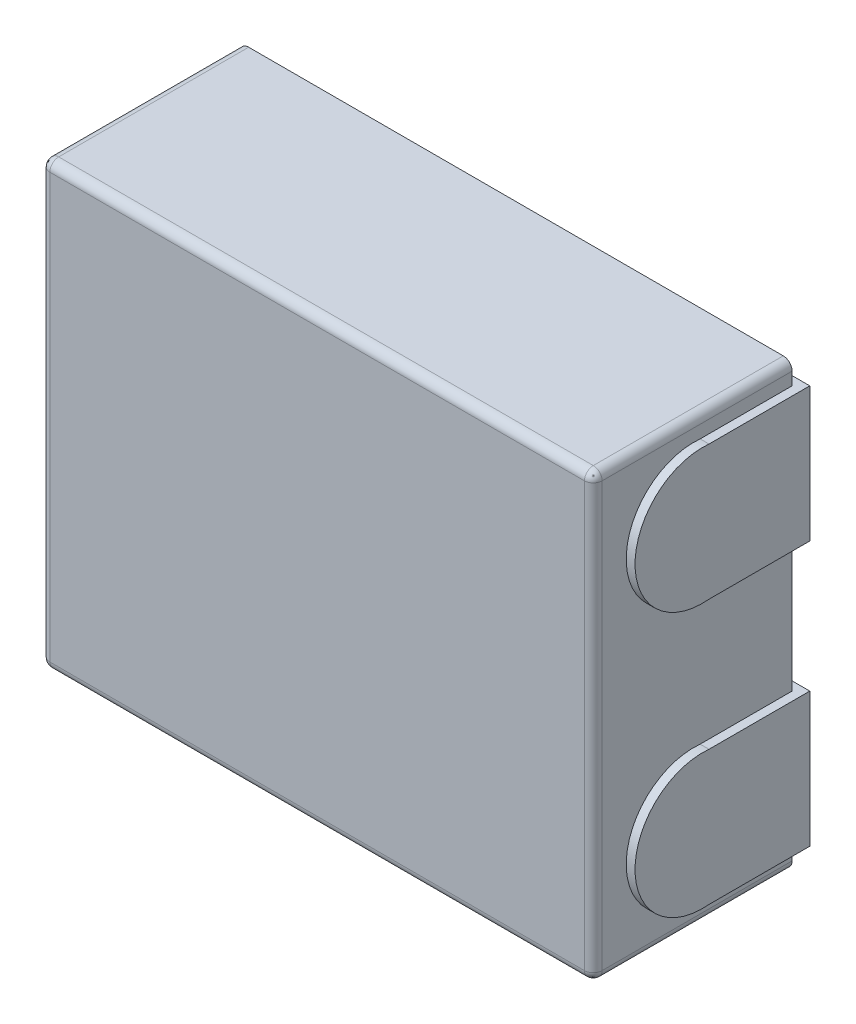
ISO-10303-21;
HEADER;
FILE_DESCRIPTION(('STEP AP214'),'2;1');
FILE_NAME('part.step','',(''),(''),'','','');
FILE_SCHEMA(('AUTOMOTIVE_DESIGN { 1 0 10303 214 1 1 1 1 }'));
ENDSEC;
DATA;
#1=APPLICATION_CONTEXT('core data for automotive mechanical design processes');
#2=APPLICATION_PROTOCOL_DEFINITION('international standard','automotive_design',2000,#1);
#3=PRODUCT_CONTEXT('',#1,'mechanical');
#4=PRODUCT('Part','Part','',(#3));
#5=PRODUCT_RELATED_PRODUCT_CATEGORY('part','',(#4));
#6=PRODUCT_DEFINITION_FORMATION('','',#4);
#7=PRODUCT_DEFINITION_CONTEXT('part definition',#1,'design');
#8=PRODUCT_DEFINITION('design','',#6,#7);
#9=PRODUCT_DEFINITION_SHAPE('','',#8);
#10=(LENGTH_UNIT() NAMED_UNIT(*) SI_UNIT(.MILLI.,.METRE.));
#11=(NAMED_UNIT(*) PLANE_ANGLE_UNIT() SI_UNIT($,.RADIAN.));
#12=(NAMED_UNIT(*) SI_UNIT($,.STERADIAN.) SOLID_ANGLE_UNIT());
#13=UNCERTAINTY_MEASURE_WITH_UNIT(LENGTH_MEASURE(1.E-05),#10,'distance_accuracy_value','');
#14=(GEOMETRIC_REPRESENTATION_CONTEXT(3) GLOBAL_UNCERTAINTY_ASSIGNED_CONTEXT((#13)) GLOBAL_UNIT_ASSIGNED_CONTEXT((#10,
#11,#12)) REPRESENTATION_CONTEXT('',''));
#15=CARTESIAN_POINT('',(0.,0.,0.));
#16=DIRECTION('',(0.,0.,1.));
#17=DIRECTION('',(1.,0.,0.));
#18=AXIS2_PLACEMENT_3D('',#15,#16,#17);
#19=CARTESIAN_POINT('',(-4.30252459766994,-0.304168853033011,-0.0199999999999997));
#20=DIRECTION('',(0.,0.,-1.));
#21=DIRECTION('',(-1.,0.,0.));
#22=AXIS2_PLACEMENT_3D('',#19,#20,#21);
#23=PLANE('',#22);
#24=DIRECTION('',(0.,-1.,0.));
#25=VECTOR('',#24,1.);
#26=CARTESIAN_POINT('',(-4.00252459766994,-0.152084426516506,-0.0199999999999998));
#27=LINE('',#26,#25);
#28=CARTESIAN_POINT('',(-4.00252459766994,0.,-0.0199999999999998));
#29=VERTEX_POINT('',#28);
#30=CARTESIAN_POINT('',(-4.00252459766994,-0.304168853033011,-0.0199999999999998));
#31=VERTEX_POINT('',#30);
#32=EDGE_CURVE('P0_E51',#29,#31,#27,.T.);
#33=ORIENTED_EDGE('',*,*,#32,.T.);
#34=DIRECTION('',(1.,0.,0.));
#35=VECTOR('',#34,1.);
#36=CARTESIAN_POINT('',(-4.30252459766994,-0.304168853033011,-0.0199999999999997));
#37=LINE('',#36,#35);
#38=CARTESIAN_POINT('',(-4.30252459766994,-0.304168853033011,-0.0199999999999997));
#39=VERTEX_POINT('',#38);
#40=EDGE_CURVE('P0_E70',#39,#31,#37,.T.);
#41=ORIENTED_EDGE('',*,*,#40,.F.);
#42=DIRECTION('',(0.,-1.,0.));
#43=VECTOR('',#42,1.);
#44=CARTESIAN_POINT('',(-4.30252459766994,-0.152084426516506,-0.0199999999999997));
#45=LINE('',#44,#43);
#46=CARTESIAN_POINT('',(-4.30252459766994,0.,-0.0199999999999998));
#47=VERTEX_POINT('',#46);
#48=EDGE_CURVE('P0_E60',#47,#39,#45,.T.);
#49=ORIENTED_EDGE('',*,*,#48,.F.);
#50=DIRECTION('',(1.,0.,0.));
#51=VECTOR('',#50,1.);
#52=CARTESIAN_POINT('',(-4.30252459766994,0.,-0.0199999999999998));
#53=LINE('',#52,#51);
#54=EDGE_CURVE('P0_E90',#29,#47,#53,.F.);
#55=ORIENTED_EDGE('',*,*,#54,.F.);
#56=EDGE_LOOP('',(#33,#41,#49,#55));
#57=FACE_BOUND('',#56,.T.);
#58=ADVANCED_FACE('P0_F16',(#57),#23,.T.);
#59=CARTESIAN_POINT('',(-4.30252459766994,-0.152084426516506,0.137210257429789));
#60=DIRECTION('',(-1.,0.,0.));
#61=DIRECTION('',(0.,-1.,0.));
#62=AXIS2_PLACEMENT_3D('',#59,#60,#61);
#63=PLANE('',#62);
#64=CARTESIAN_POINT('',(-4.30252459766994,-0.152084426516506,0.222703998621652));
#65=DIRECTION('',(1.,0.,0.));
#66=DIRECTION('',(0.,0.,-1.));
#67=AXIS2_PLACEMENT_3D('',#64,#65,#66);
#68=CIRCLE('',#67,0.152788159551015);
#69=CARTESIAN_POINT('',(-4.30252459766994,0.,0.208056510436575));
#70=VERTEX_POINT('',#69);
#71=CARTESIAN_POINT('',(-4.30252459766994,-0.304168853033011,0.208056510436569));
#72=VERTEX_POINT('',#71);
#73=EDGE_CURVE('P0_E19',#70,#72,#68,.T.);
#74=ORIENTED_EDGE('',*,*,#73,.F.);
#75=DIRECTION('',(0.,0.,1.));
#76=VECTOR('',#75,1.);
#77=CARTESIAN_POINT('',(-4.30252459766994,0.,-0.0199999999999997));
#78=LINE('',#77,#76);
#79=EDGE_CURVE('P0_E66',#47,#70,#78,.T.);
#80=ORIENTED_EDGE('',*,*,#79,.F.);
#81=ORIENTED_EDGE('',*,*,#48,.T.);
#82=DIRECTION('',(0.,0.,-1.));
#83=VECTOR('',#82,1.);
#84=CARTESIAN_POINT('',(-4.30252459766994,-0.304168853033011,0.208056510436572));
#85=LINE('',#84,#83);
#86=EDGE_CURVE('P0_E64',#72,#39,#85,.T.);
#87=ORIENTED_EDGE('',*,*,#86,.F.);
#88=EDGE_LOOP('',(#74,#80,#81,#87));
#89=FACE_BOUND('',#88,.T.);
#90=ADVANCED_FACE('P0_F62',(#89),#63,.T.);
#91=CARTESIAN_POINT('',(-4.30252459766994,-0.304168853033011,0.208056510436572));
#92=DIRECTION('',(0.,-1.,0.));
#93=DIRECTION('',(0.,0.,-1.));
#94=AXIS2_PLACEMENT_3D('',#91,#92,#93);
#95=PLANE('',#94);
#96=DIRECTION('',(0.,0.,1.));
#97=VECTOR('',#96,1.);
#98=CARTESIAN_POINT('',(-4.00252459766994,-0.304168853033011,0.137210257429789));
#99=LINE('',#98,#97);
#100=CARTESIAN_POINT('',(-4.00252459766994,-0.304168853033011,0.208056510436569));
#101=VERTEX_POINT('',#100);
#102=EDGE_CURVE('P0_E72',#31,#101,#99,.T.);
#103=ORIENTED_EDGE('',*,*,#102,.T.);
#104=DIRECTION('',(1.,0.,0.));
#105=VECTOR('',#104,1.);
#106=CARTESIAN_POINT('',(-4.30252459766994,-0.304168853033011,0.208056510436572));
#107=LINE('',#106,#105);
#108=EDGE_CURVE('P0_E76',#72,#101,#107,.T.);
#109=ORIENTED_EDGE('',*,*,#108,.F.);
#110=ORIENTED_EDGE('',*,*,#86,.T.);
#111=ORIENTED_EDGE('',*,*,#40,.T.);
#112=EDGE_LOOP('',(#103,#109,#110,#111));
#113=FACE_BOUND('',#112,.T.);
#114=ADVANCED_FACE('P0_F74',(#113),#95,.T.);
#115=CARTESIAN_POINT('',(-4.00252459766994,-0.152084426516506,0.137210257429789));
#116=DIRECTION('',(-1.,0.,0.));
#117=DIRECTION('',(0.,-1.,0.));
#118=AXIS2_PLACEMENT_3D('',#115,#116,#117);
#119=PLANE('',#118);
#120=DIRECTION('',(0.,0.,1.));
#121=VECTOR('',#120,1.);
#122=CARTESIAN_POINT('',(-4.00252459766994,0.,-0.0199999999999997));
#123=LINE('',#122,#121);
#124=CARTESIAN_POINT('',(-4.00252459766994,0.,0.208056510436575));
#125=VERTEX_POINT('',#124);
#126=EDGE_CURVE('P0_E34',#125,#29,#123,.F.);
#127=ORIENTED_EDGE('',*,*,#126,.F.);
#128=CARTESIAN_POINT('',(-4.00252459766994,-0.152084426516506,0.222703998621652));
#129=DIRECTION('',(1.,0.,0.));
#130=DIRECTION('',(0.,0.,-1.));
#131=AXIS2_PLACEMENT_3D('',#128,#129,#130);
#132=CIRCLE('',#131,0.152788159551015);
#133=EDGE_CURVE('P0_E25',#101,#125,#132,.F.);
#134=ORIENTED_EDGE('',*,*,#133,.F.);
#135=ORIENTED_EDGE('',*,*,#102,.F.);
#136=ORIENTED_EDGE('',*,*,#32,.F.);
#137=EDGE_LOOP('',(#127,#134,#135,#136));
#138=FACE_BOUND('',#137,.T.);
#139=ADVANCED_FACE('P0_F112',(#138),#119,.F.);
#140=CARTESIAN_POINT('',(-4.30252459766994,0.,-0.0199999999999997));
#141=DIRECTION('',(0.,1.,0.));
#142=DIRECTION('',(0.,0.,1.));
#143=AXIS2_PLACEMENT_3D('',#140,#141,#142);
#144=PLANE('',#143);
#145=ORIENTED_EDGE('',*,*,#126,.T.);
#146=ORIENTED_EDGE('',*,*,#54,.T.);
#147=ORIENTED_EDGE('',*,*,#79,.T.);
#148=DIRECTION('',(1.,0.,0.));
#149=VECTOR('',#148,1.);
#150=CARTESIAN_POINT('',(-4.30252459766994,0.,0.208056510436572));
#151=LINE('',#150,#149);
#152=EDGE_CURVE('P0_E11',#125,#70,#151,.F.);
#153=ORIENTED_EDGE('',*,*,#152,.F.);
#154=EDGE_LOOP('',(#145,#146,#147,#153));
#155=FACE_BOUND('',#154,.T.);
#156=ADVANCED_FACE('P0_F104',(#155),#144,.T.);
#157=CARTESIAN_POINT('',(-4.30252459766994,-0.152084426516506,0.222703998621652));
#158=DIRECTION('',(1.,0.,0.));
#159=DIRECTION('',(0.,0.,-1.));
#160=AXIS2_PLACEMENT_3D('',#157,#158,#159);
#161=CYLINDRICAL_SURFACE('',#160,0.152788159551015);
#162=ORIENTED_EDGE('',*,*,#133,.T.);
#163=ORIENTED_EDGE('',*,*,#152,.T.);
#164=ORIENTED_EDGE('',*,*,#73,.T.);
#165=ORIENTED_EDGE('',*,*,#108,.T.);
#166=EDGE_LOOP('',(#162,#163,#164,#165));
#167=FACE_BOUND('',#166,.T.);
#168=ADVANCED_FACE('P0_F105',(#167),#161,.T.);
#169=CLOSED_SHELL('',(#58,#90,#114,#139,#156,#168));
#170=MANIFOLD_SOLID_BREP('P0_B1',#169);
#171=CARTESIAN_POINT('',(-4.30252459766994,-0.902482697205198,-0.0199999999999997));
#172=DIRECTION('',(0.,0.,-1.));
#173=DIRECTION('',(-1.,0.,0.));
#174=AXIS2_PLACEMENT_3D('',#171,#172,#173);
#175=PLANE('',#174);
#176=DIRECTION('',(0.,1.,0.));
#177=VECTOR('',#176,1.);
#178=CARTESIAN_POINT('',(-4.00252459766994,-0.750398270688693,-0.0199999999999998));
#179=LINE('',#178,#177);
#180=CARTESIAN_POINT('',(-4.00252459766994,-0.902482697205198,-0.0199999999999998));
#181=VERTEX_POINT('',#180);
#182=CARTESIAN_POINT('',(-4.00252459766994,-0.598313844172187,-0.0199999999999998));
#183=VERTEX_POINT('',#182);
#184=EDGE_CURVE('P1_E51',#181,#183,#179,.T.);
#185=ORIENTED_EDGE('',*,*,#184,.F.);
#186=DIRECTION('',(1.,0.,0.));
#187=VECTOR('',#186,1.);
#188=CARTESIAN_POINT('',(-4.30252459766994,-0.902482697205198,-0.0199999999999997));
#189=LINE('',#188,#187);
#190=CARTESIAN_POINT('',(-4.30252459766994,-0.902482697205198,-0.0199999999999997));
#191=VERTEX_POINT('',#190);
#192=EDGE_CURVE('P1_E70',#191,#181,#189,.T.);
#193=ORIENTED_EDGE('',*,*,#192,.F.);
#194=DIRECTION('',(0.,1.,0.));
#195=VECTOR('',#194,1.);
#196=CARTESIAN_POINT('',(-4.30252459766994,-0.750398270688693,-0.0199999999999997));
#197=LINE('',#196,#195);
#198=CARTESIAN_POINT('',(-4.30252459766994,-0.598313844172187,-0.0199999999999998));
#199=VERTEX_POINT('',#198);
#200=EDGE_CURVE('P1_E60',#191,#199,#197,.T.);
#201=ORIENTED_EDGE('',*,*,#200,.T.);
#202=DIRECTION('',(1.,0.,0.));
#203=VECTOR('',#202,1.);
#204=CARTESIAN_POINT('',(-4.30252459766994,-0.598313844172187,-0.0199999999999998));
#205=LINE('',#204,#203);
#206=EDGE_CURVE('P1_E90',#183,#199,#205,.F.);
#207=ORIENTED_EDGE('',*,*,#206,.F.);
#208=EDGE_LOOP('',(#185,#193,#201,#207));
#209=FACE_BOUND('',#208,.T.);
#210=ADVANCED_FACE('P1_F16',(#209),#175,.T.);
#211=CARTESIAN_POINT('',(-4.30252459766994,-0.750398270688693,0.137210257429789));
#212=DIRECTION('',(1.,0.,0.));
#213=DIRECTION('',(0.,0.,-1.));
#214=AXIS2_PLACEMENT_3D('',#211,#212,#213);
#215=PLANE('',#214);
#216=ORIENTED_EDGE('',*,*,#200,.F.);
#217=DIRECTION('',(0.,0.,-1.));
#218=VECTOR('',#217,1.);
#219=CARTESIAN_POINT('',(-4.30252459766994,-0.902482697205198,0.208056510436572));
#220=LINE('',#219,#218);
#221=CARTESIAN_POINT('',(-4.30252459766994,-0.902482697205198,0.208056510436569));
#222=VERTEX_POINT('',#221);
#223=EDGE_CURVE('P1_E64',#222,#191,#220,.T.);
#224=ORIENTED_EDGE('',*,*,#223,.F.);
#225=CARTESIAN_POINT('',(-4.30252459766994,-0.750398270688693,0.222703998621652));
#226=DIRECTION('',(1.,0.,0.));
#227=DIRECTION('',(0.,0.,-1.));
#228=AXIS2_PLACEMENT_3D('',#225,#226,#227);
#229=CIRCLE('',#228,0.152788159551015);
#230=CARTESIAN_POINT('',(-4.30252459766994,-0.598313844172187,0.208056510436575));
#231=VERTEX_POINT('',#230);
#232=EDGE_CURVE('P1_E19',#231,#222,#229,.T.);
#233=ORIENTED_EDGE('',*,*,#232,.F.);
#234=DIRECTION('',(0.,0.,1.));
#235=VECTOR('',#234,1.);
#236=CARTESIAN_POINT('',(-4.30252459766994,-0.598313844172187,-0.0199999999999997));
#237=LINE('',#236,#235);
#238=EDGE_CURVE('P1_E66',#199,#231,#237,.T.);
#239=ORIENTED_EDGE('',*,*,#238,.F.);
#240=EDGE_LOOP('',(#216,#224,#233,#239));
#241=FACE_BOUND('',#240,.T.);
#242=ADVANCED_FACE('P1_F62',(#241),#215,.F.);
#243=CARTESIAN_POINT('',(-4.30252459766994,-0.902482697205198,0.208056510436572));
#244=DIRECTION('',(0.,-1.,0.));
#245=DIRECTION('',(0.,0.,-1.));
#246=AXIS2_PLACEMENT_3D('',#243,#244,#245);
#247=PLANE('',#246);
#248=DIRECTION('',(0.,0.,-1.));
#249=VECTOR('',#248,1.);
#250=CARTESIAN_POINT('',(-4.00252459766994,-0.902482697205198,0.137210257429789));
#251=LINE('',#250,#249);
#252=CARTESIAN_POINT('',(-4.00252459766994,-0.902482697205198,0.208056510436569));
#253=VERTEX_POINT('',#252);
#254=EDGE_CURVE('P1_E72',#253,#181,#251,.T.);
#255=ORIENTED_EDGE('',*,*,#254,.F.);
#256=DIRECTION('',(1.,0.,0.));
#257=VECTOR('',#256,1.);
#258=CARTESIAN_POINT('',(-4.30252459766994,-0.902482697205199,0.208056510436572));
#259=LINE('',#258,#257);
#260=EDGE_CURVE('P1_E76',#222,#253,#259,.T.);
#261=ORIENTED_EDGE('',*,*,#260,.F.);
#262=ORIENTED_EDGE('',*,*,#223,.T.);
#263=ORIENTED_EDGE('',*,*,#192,.T.);
#264=EDGE_LOOP('',(#255,#261,#262,#263));
#265=FACE_BOUND('',#264,.T.);
#266=ADVANCED_FACE('P1_F74',(#265),#247,.T.);
#267=CARTESIAN_POINT('',(-4.00252459766994,-0.750398270688693,0.137210257429789));
#268=DIRECTION('',(1.,0.,0.));
#269=DIRECTION('',(0.,0.,-1.));
#270=AXIS2_PLACEMENT_3D('',#267,#268,#269);
#271=PLANE('',#270);
#272=ORIENTED_EDGE('',*,*,#254,.T.);
#273=ORIENTED_EDGE('',*,*,#184,.T.);
#274=DIRECTION('',(0.,0.,1.));
#275=VECTOR('',#274,1.);
#276=CARTESIAN_POINT('',(-4.00252459766994,-0.598313844172187,-0.0199999999999997));
#277=LINE('',#276,#275);
#278=CARTESIAN_POINT('',(-4.00252459766994,-0.598313844172187,0.208056510436575));
#279=VERTEX_POINT('',#278);
#280=EDGE_CURVE('P1_E34',#279,#183,#277,.F.);
#281=ORIENTED_EDGE('',*,*,#280,.F.);
#282=CARTESIAN_POINT('',(-4.00252459766994,-0.750398270688693,0.222703998621652));
#283=DIRECTION('',(1.,0.,0.));
#284=DIRECTION('',(0.,0.,-1.));
#285=AXIS2_PLACEMENT_3D('',#282,#283,#284);
#286=CIRCLE('',#285,0.152788159551015);
#287=EDGE_CURVE('P1_E25',#253,#279,#286,.F.);
#288=ORIENTED_EDGE('',*,*,#287,.F.);
#289=EDGE_LOOP('',(#272,#273,#281,#288));
#290=FACE_BOUND('',#289,.T.);
#291=ADVANCED_FACE('P1_F112',(#290),#271,.T.);
#292=CARTESIAN_POINT('',(-4.30252459766994,-0.598313844172187,-0.0199999999999997));
#293=DIRECTION('',(0.,1.,0.));
#294=DIRECTION('',(0.,0.,1.));
#295=AXIS2_PLACEMENT_3D('',#292,#293,#294);
#296=PLANE('',#295);
#297=ORIENTED_EDGE('',*,*,#280,.T.);
#298=ORIENTED_EDGE('',*,*,#206,.T.);
#299=ORIENTED_EDGE('',*,*,#238,.T.);
#300=DIRECTION('',(1.,0.,0.));
#301=VECTOR('',#300,1.);
#302=CARTESIAN_POINT('',(-4.30252459766994,-0.598313844172187,0.208056510436572));
#303=LINE('',#302,#301);
#304=EDGE_CURVE('P1_E11',#279,#231,#303,.F.);
#305=ORIENTED_EDGE('',*,*,#304,.F.);
#306=EDGE_LOOP('',(#297,#298,#299,#305));
#307=FACE_BOUND('',#306,.T.);
#308=ADVANCED_FACE('P1_F104',(#307),#296,.T.);
#309=CARTESIAN_POINT('',(-4.30252459766994,-0.750398270688693,0.222703998621652));
#310=DIRECTION('',(1.,0.,0.));
#311=DIRECTION('',(0.,0.,-1.));
#312=AXIS2_PLACEMENT_3D('',#309,#310,#311);
#313=CYLINDRICAL_SURFACE('',#312,0.152788159551015);
#314=ORIENTED_EDGE('',*,*,#287,.T.);
#315=ORIENTED_EDGE('',*,*,#304,.T.);
#316=ORIENTED_EDGE('',*,*,#232,.T.);
#317=ORIENTED_EDGE('',*,*,#260,.T.);
#318=EDGE_LOOP('',(#314,#315,#316,#317));
#319=FACE_BOUND('',#318,.T.);
#320=ADVANCED_FACE('P1_F105',(#319),#313,.T.);
#321=CLOSED_SHELL('',(#210,#242,#266,#291,#308,#320));
#322=MANIFOLD_SOLID_BREP('P1_B1',#321);
#323=CARTESIAN_POINT('',(-3.65752459766994,-0.451241348602599,0.45));
#324=DIRECTION('',(0.,0.,1.));
#325=DIRECTION('',(1.,0.,0.));
#326=AXIS2_PLACEMENT_3D('',#323,#324,#325);
#327=PLANE('',#326);
#328=DIRECTION('',(-1.,0.,0.));
#329=VECTOR('',#328,1.);
#330=CARTESIAN_POINT('',(-3.34502459766994,0.0287586513974009,0.45));
#331=LINE('',#330,#329);
#332=CARTESIAN_POINT('',(-4.26252459766994,0.0287586513974009,0.45));
#333=VERTEX_POINT('',#332);
#334=CARTESIAN_POINT('',(-3.05252459766994,0.0287586513974009,0.45));
#335=VERTEX_POINT('',#334);
#336=EDGE_CURVE('P2_E260',#333,#335,#331,.F.);
#337=ORIENTED_EDGE('',*,*,#336,.F.);
#338=DIRECTION('',(0.,-1.,0.));
#339=VECTOR('',#338,1.);
#340=CARTESIAN_POINT('',(-4.26252459766994,-0.201241348602599,0.45));
#341=LINE('',#340,#339);
#342=CARTESIAN_POINT('',(-4.26252459766994,-0.931241348602599,0.45));
#343=VERTEX_POINT('',#342);
#344=EDGE_CURVE('P2_E258',#343,#333,#341,.F.);
#345=ORIENTED_EDGE('',*,*,#344,.F.);
#346=DIRECTION('',(1.,0.,0.));
#347=VECTOR('',#346,1.);
#348=CARTESIAN_POINT('',(-3.97002459766994,-0.931241348602599,0.45));
#349=LINE('',#348,#347);
#350=CARTESIAN_POINT('',(-3.05252459766994,-0.931241348602599,0.45));
#351=VERTEX_POINT('',#350);
#352=EDGE_CURVE('P2_E253',#351,#343,#349,.F.);
#353=ORIENTED_EDGE('',*,*,#352,.F.);
#354=DIRECTION('',(0.,1.,0.));
#355=VECTOR('',#354,1.);
#356=CARTESIAN_POINT('',(-3.05252459766994,-0.701241348602599,0.45));
#357=LINE('',#356,#355);
#358=EDGE_CURVE('P2_E95',#335,#351,#357,.F.);
#359=ORIENTED_EDGE('',*,*,#358,.F.);
#360=EDGE_LOOP('',(#337,#345,#353,#359));
#361=FACE_BOUND('',#360,.T.);
#362=ADVANCED_FACE('P2_F16',(#361),#327,.T.);
#363=CARTESIAN_POINT('',(-3.05252459766994,-0.701241348602599,0.43));
#364=DIRECTION('',(0.,1.,0.));
#365=DIRECTION('',(0.,0.,1.));
#366=AXIS2_PLACEMENT_3D('',#363,#364,#365);
#367=CYLINDRICAL_SURFACE('',#366,0.02);
#368=CARTESIAN_POINT('',(-3.05252459766994,-0.931241348602599,0.43));
#369=DIRECTION('',(0.,1.,0.));
#370=DIRECTION('',(0.,0.,1.));
#371=AXIS2_PLACEMENT_3D('',#368,#369,#370);
#372=CIRCLE('',#371,0.02);
#373=CARTESIAN_POINT('',(-3.03252459766994,-0.931241348602599,0.43));
#374=VERTEX_POINT('',#373);
#375=EDGE_CURVE('P2_E246',#374,#351,#372,.F.);
#376=ORIENTED_EDGE('',*,*,#375,.F.);
#377=DIRECTION('',(0.,1.,0.));
#378=VECTOR('',#377,1.);
#379=CARTESIAN_POINT('',(-3.03252459766994,-0.951241348602599,0.43));
#380=LINE('',#379,#378);
#381=CARTESIAN_POINT('',(-3.03252459766994,0.0287586513974009,0.43));
#382=VERTEX_POINT('',#381);
#383=EDGE_CURVE('P2_E118',#382,#374,#380,.F.);
#384=ORIENTED_EDGE('',*,*,#383,.F.);
#385=CARTESIAN_POINT('',(-3.05252459766994,0.0287586513974009,0.43));
#386=DIRECTION('',(0.,1.,0.));
#387=DIRECTION('',(0.,0.,1.));
#388=AXIS2_PLACEMENT_3D('',#385,#386,#387);
#389=CIRCLE('',#388,0.02);
#390=EDGE_CURVE('P2_E19',#335,#382,#389,.T.);
#391=ORIENTED_EDGE('',*,*,#390,.F.);
#392=ORIENTED_EDGE('',*,*,#358,.T.);
#393=EDGE_LOOP('',(#376,#384,#391,#392));
#394=FACE_BOUND('',#393,.T.);
#395=ADVANCED_FACE('P2_F104',(#394),#367,.T.);
#396=CARTESIAN_POINT('',(-3.05252459766994,0.0287586513974009,0.43));
#397=DIRECTION('',(0.577350269189631,0.577350269189627,0.57735026918962));
#398=DIRECTION('',(-0.707106781186543,0.,0.707106781186552));
#399=AXIS2_PLACEMENT_3D('',#396,#397,#398);
#400=SPHERICAL_SURFACE('',#399,0.02);
#401=CARTESIAN_POINT('',(-3.04097759228615,0.0403056567811935,0.441547005383792));
#402=VERTEX_POINT('',#401);
#403=VERTEX_LOOP('',#402);
#404=FACE_BOUND('',#403,.T.);
#405=CARTESIAN_POINT('',(-3.05252459766994,0.0287586513974009,0.43));
#406=DIRECTION('',(0.,0.,1.));
#407=DIRECTION('',(1.,0.,0.));
#408=AXIS2_PLACEMENT_3D('',#405,#406,#407);
#409=CIRCLE('',#408,0.02);
#410=CARTESIAN_POINT('',(-3.05252459766994,0.0487586513974009,0.43));
#411=VERTEX_POINT('',#410);
#412=EDGE_CURVE('P2_E110',#411,#382,#409,.F.);
#413=ORIENTED_EDGE('',*,*,#412,.F.);
#414=CARTESIAN_POINT('',(-3.05252459766994,0.0287586513974009,0.43));
#415=DIRECTION('',(-1.,0.,0.));
#416=DIRECTION('',(0.,0.,1.));
#417=AXIS2_PLACEMENT_3D('',#414,#415,#416);
#418=CIRCLE('',#417,0.02);
#419=EDGE_CURVE('P2_E112',#335,#411,#418,.T.);
#420=ORIENTED_EDGE('',*,*,#419,.F.);
#421=ORIENTED_EDGE('',*,*,#390,.T.);
#422=EDGE_LOOP('',(#413,#420,#421));
#423=FACE_BOUND('',#422,.T.);
#424=ADVANCED_FACE('P2_F100',(#404,#423),#400,.T.);
#425=CARTESIAN_POINT('',(-3.34502459766994,0.0287586513974009,0.43));
#426=DIRECTION('',(-1.,0.,0.));
#427=DIRECTION('',(0.,0.,1.));
#428=AXIS2_PLACEMENT_3D('',#425,#426,#427);
#429=CYLINDRICAL_SURFACE('',#428,0.02);
#430=ORIENTED_EDGE('',*,*,#419,.T.);
#431=DIRECTION('',(1.,0.,0.));
#432=VECTOR('',#431,1.);
#433=CARTESIAN_POINT('',(-3.03252459766994,0.0487586513974009,0.43));
#434=LINE('',#433,#432);
#435=CARTESIAN_POINT('',(-4.26252459766994,0.0487586513974009,0.43));
#436=VERTEX_POINT('',#435);
#437=EDGE_CURVE('P2_E123',#436,#411,#434,.T.);
#438=ORIENTED_EDGE('',*,*,#437,.F.);
#439=CARTESIAN_POINT('',(-4.26252459766994,0.0287586513974009,0.43));
#440=DIRECTION('',(-1.,0.,0.));
#441=DIRECTION('',(0.,0.,1.));
#442=AXIS2_PLACEMENT_3D('',#439,#440,#441);
#443=CIRCLE('',#442,0.02);
#444=EDGE_CURVE('P2_E259',#333,#436,#443,.T.);
#445=ORIENTED_EDGE('',*,*,#444,.F.);
#446=ORIENTED_EDGE('',*,*,#336,.T.);
#447=EDGE_LOOP('',(#430,#438,#445,#446));
#448=FACE_BOUND('',#447,.T.);
#449=ADVANCED_FACE('P2_F103',(#448),#429,.T.);
#450=CARTESIAN_POINT('',(-4.26252459766994,0.0287586513974009,0.43));
#451=DIRECTION('',(-0.577350269189624,0.577350269189616,0.577350269189638));
#452=DIRECTION('',(-0.70710678118656,0.,-0.707106781186535));
#453=AXIS2_PLACEMENT_3D('',#450,#451,#452);
#454=SPHERICAL_SURFACE('',#453,0.02);
#455=CARTESIAN_POINT('',(-4.27407160305373,0.0403056567811933,0.441547005383793));
#456=VERTEX_POINT('',#455);
#457=VERTEX_LOOP('',#456);
#458=FACE_BOUND('',#457,.T.);
#459=CARTESIAN_POINT('',(-4.26252459766994,0.0287586513974009,0.43));
#460=DIRECTION('',(0.,0.,1.));
#461=DIRECTION('',(1.,0.,0.));
#462=AXIS2_PLACEMENT_3D('',#459,#460,#461);
#463=CIRCLE('',#462,0.02);
#464=CARTESIAN_POINT('',(-4.28252459766994,0.0287586513974009,0.43));
#465=VERTEX_POINT('',#464);
#466=EDGE_CURVE('P2_E131',#465,#436,#463,.F.);
#467=ORIENTED_EDGE('',*,*,#466,.F.);
#468=CARTESIAN_POINT('',(-4.26252459766994,0.0287586513974009,0.43));
#469=DIRECTION('',(0.,-1.,0.));
#470=DIRECTION('',(0.,0.,-1.));
#471=AXIS2_PLACEMENT_3D('',#468,#469,#470);
#472=CIRCLE('',#471,0.02);
#473=EDGE_CURVE('P2_E256',#333,#465,#472,.T.);
#474=ORIENTED_EDGE('',*,*,#473,.F.);
#475=ORIENTED_EDGE('',*,*,#444,.T.);
#476=EDGE_LOOP('',(#467,#474,#475));
#477=FACE_BOUND('',#476,.T.);
#478=ADVANCED_FACE('P2_F176',(#458,#477),#454,.T.);
#479=CARTESIAN_POINT('',(-4.26252459766994,-0.201241348602599,0.43));
#480=DIRECTION('',(0.,-1.,0.));
#481=DIRECTION('',(0.,0.,-1.));
#482=AXIS2_PLACEMENT_3D('',#479,#480,#481);
#483=CYLINDRICAL_SURFACE('',#482,0.02);
#484=ORIENTED_EDGE('',*,*,#473,.T.);
#485=DIRECTION('',(0.,1.,0.));
#486=VECTOR('',#485,1.);
#487=CARTESIAN_POINT('',(-4.28252459766994,0.0487586513974009,0.43));
#488=LINE('',#487,#486);
#489=CARTESIAN_POINT('',(-4.28252459766994,-0.931241348602599,0.43));
#490=VERTEX_POINT('',#489);
#491=EDGE_CURVE('P2_E170',#490,#465,#488,.T.);
#492=ORIENTED_EDGE('',*,*,#491,.F.);
#493=CARTESIAN_POINT('',(-4.26252459766994,-0.931241348602599,0.43));
#494=DIRECTION('',(0.,-1.,0.));
#495=DIRECTION('',(0.,0.,-1.));
#496=AXIS2_PLACEMENT_3D('',#493,#494,#495);
#497=CIRCLE('',#496,0.02);
#498=EDGE_CURVE('P2_E254',#343,#490,#497,.T.);
#499=ORIENTED_EDGE('',*,*,#498,.F.);
#500=ORIENTED_EDGE('',*,*,#344,.T.);
#501=EDGE_LOOP('',(#484,#492,#499,#500));
#502=FACE_BOUND('',#501,.T.);
#503=ADVANCED_FACE('P2_F166',(#502),#483,.T.);
#504=CARTESIAN_POINT('',(-4.26252459766994,-0.931241348602599,0.43));
#505=DIRECTION('',(-0.577350269189625,-0.577350269189616,0.577350269189637));
#506=DIRECTION('',(-0.707106781186559,0.,-0.707106781186536));
#507=AXIS2_PLACEMENT_3D('',#504,#505,#506);
#508=SPHERICAL_SURFACE('',#507,0.02);
#509=CARTESIAN_POINT('',(-4.27407160305373,-0.942788353986391,0.441547005383793));
#510=VERTEX_POINT('',#509);
#511=VERTEX_LOOP('',#510);
#512=FACE_BOUND('',#511,.T.);
#513=CARTESIAN_POINT('',(-4.26252459766994,-0.931241348602599,0.43));
#514=DIRECTION('',(0.,0.,1.));
#515=DIRECTION('',(1.,0.,0.));
#516=AXIS2_PLACEMENT_3D('',#513,#514,#515);
#517=CIRCLE('',#516,0.02);
#518=CARTESIAN_POINT('',(-4.26252459766994,-0.951241348602599,0.43));
#519=VERTEX_POINT('',#518);
#520=EDGE_CURVE('P2_E240',#519,#490,#517,.F.);
#521=ORIENTED_EDGE('',*,*,#520,.F.);
#522=CARTESIAN_POINT('',(-4.26252459766994,-0.931241348602599,0.43));
#523=DIRECTION('',(1.,0.,0.));
#524=DIRECTION('',(0.,0.,-1.));
#525=AXIS2_PLACEMENT_3D('',#522,#523,#524);
#526=CIRCLE('',#525,0.02);
#527=EDGE_CURVE('P2_E251',#343,#519,#526,.T.);
#528=ORIENTED_EDGE('',*,*,#527,.F.);
#529=ORIENTED_EDGE('',*,*,#498,.T.);
#530=EDGE_LOOP('',(#521,#528,#529));
#531=FACE_BOUND('',#530,.T.);
#532=ADVANCED_FACE('P2_F161',(#512,#531),#508,.T.);
#533=CARTESIAN_POINT('',(-3.97002459766994,-0.931241348602599,0.43));
#534=DIRECTION('',(1.,0.,0.));
#535=DIRECTION('',(0.,0.,-1.));
#536=AXIS2_PLACEMENT_3D('',#533,#534,#535);
#537=CYLINDRICAL_SURFACE('',#536,0.02);
#538=ORIENTED_EDGE('',*,*,#527,.T.);
#539=DIRECTION('',(1.,0.,0.));
#540=VECTOR('',#539,1.);
#541=CARTESIAN_POINT('',(-4.28252459766994,-0.951241348602599,0.43));
#542=LINE('',#541,#540);
#543=CARTESIAN_POINT('',(-3.05252459766994,-0.951241348602599,0.43));
#544=VERTEX_POINT('',#543);
#545=EDGE_CURVE('P2_E142',#544,#519,#542,.F.);
#546=ORIENTED_EDGE('',*,*,#545,.F.);
#547=CARTESIAN_POINT('',(-3.05252459766994,-0.931241348602599,0.43));
#548=DIRECTION('',(1.,0.,0.));
#549=DIRECTION('',(0.,0.,-1.));
#550=AXIS2_PLACEMENT_3D('',#547,#548,#549);
#551=CIRCLE('',#550,0.02);
#552=EDGE_CURVE('P2_E249',#351,#544,#551,.T.);
#553=ORIENTED_EDGE('',*,*,#552,.F.);
#554=ORIENTED_EDGE('',*,*,#352,.T.);
#555=EDGE_LOOP('',(#538,#546,#553,#554));
#556=FACE_BOUND('',#555,.T.);
#557=ADVANCED_FACE('P2_F156',(#556),#537,.T.);
#558=CARTESIAN_POINT('',(-3.05252459766994,-0.931241348602599,0.43));
#559=DIRECTION('',(0.577350269189631,-0.577350269189626,0.57735026918962));
#560=DIRECTION('',(-0.707106781186543,0.,0.707106781186552));
#561=AXIS2_PLACEMENT_3D('',#558,#559,#560);
#562=SPHERICAL_SURFACE('',#561,0.02);
#563=CARTESIAN_POINT('',(-3.04097759228615,-0.942788353986391,0.441547005383792));
#564=VERTEX_POINT('',#563);
#565=VERTEX_LOOP('',#564);
#566=FACE_BOUND('',#565,.T.);
#567=CARTESIAN_POINT('',(-3.05252459766994,-0.931241348602599,0.43));
#568=DIRECTION('',(0.,0.,1.));
#569=DIRECTION('',(1.,0.,0.));
#570=AXIS2_PLACEMENT_3D('',#567,#568,#569);
#571=CIRCLE('',#570,0.02);
#572=EDGE_CURVE('P2_E237',#374,#544,#571,.F.);
#573=ORIENTED_EDGE('',*,*,#572,.F.);
#574=ORIENTED_EDGE('',*,*,#375,.T.);
#575=ORIENTED_EDGE('',*,*,#552,.T.);
#576=EDGE_LOOP('',(#573,#574,#575));
#577=FACE_BOUND('',#576,.T.);
#578=ADVANCED_FACE('P2_F151',(#566,#577),#562,.T.);
#579=CARTESIAN_POINT('',(-3.03252459766994,-0.951241348602599,0.));
#580=DIRECTION('',(1.,0.,0.));
#581=DIRECTION('',(0.,0.,-1.));
#582=AXIS2_PLACEMENT_3D('',#579,#580,#581);
#583=PLANE('',#582);
#584=DIRECTION('',(0.,0.,1.));
#585=VECTOR('',#584,1.);
#586=CARTESIAN_POINT('',(-3.03252459766994,0.0287586513974009,0.));
#587=LINE('',#586,#585);
#588=CARTESIAN_POINT('',(-3.03252459766994,0.0287586513974009,0.));
#589=VERTEX_POINT('',#588);
#590=EDGE_CURVE('P2_E117',#382,#589,#587,.F.);
#591=ORIENTED_EDGE('',*,*,#590,.F.);
#592=ORIENTED_EDGE('',*,*,#383,.T.);
#593=DIRECTION('',(0.,0.,1.));
#594=VECTOR('',#593,1.);
#595=CARTESIAN_POINT('',(-3.03252459766994,-0.931241348602599,0.));
#596=LINE('',#595,#594);
#597=CARTESIAN_POINT('',(-3.03252459766994,-0.931241348602599,0.));
#598=VERTEX_POINT('',#597);
#599=EDGE_CURVE('P2_E239',#598,#374,#596,.T.);
#600=ORIENTED_EDGE('',*,*,#599,.F.);
#601=DIRECTION('',(0.,1.,0.));
#602=VECTOR('',#601,1.);
#603=CARTESIAN_POINT('',(-3.03252459766994,-0.451241348602599,0.));
#604=LINE('',#603,#602);
#605=EDGE_CURVE('P2_E227',#598,#589,#604,.T.);
#606=ORIENTED_EDGE('',*,*,#605,.T.);
#607=EDGE_LOOP('',(#591,#592,#600,#606));
#608=FACE_BOUND('',#607,.T.);
#609=ADVANCED_FACE('P2_F155',(#608),#583,.T.);
#610=CARTESIAN_POINT('',(-3.05252459766994,0.0287586513974009,0.));
#611=DIRECTION('',(0.,0.,1.));
#612=DIRECTION('',(1.,0.,0.));
#613=AXIS2_PLACEMENT_3D('',#610,#611,#612);
#614=CYLINDRICAL_SURFACE('',#613,0.02);
#615=ORIENTED_EDGE('',*,*,#412,.T.);
#616=ORIENTED_EDGE('',*,*,#590,.T.);
#617=CARTESIAN_POINT('',(-3.05252459766994,0.0287586513974009,0.));
#618=DIRECTION('',(0.,0.,1.));
#619=DIRECTION('',(1.,0.,0.));
#620=AXIS2_PLACEMENT_3D('',#617,#618,#619);
#621=CIRCLE('',#620,0.02);
#622=CARTESIAN_POINT('',(-3.05252459766994,0.0487586513974009,0.));
#623=VERTEX_POINT('',#622);
#624=EDGE_CURVE('P2_E136',#589,#623,#621,.T.);
#625=ORIENTED_EDGE('',*,*,#624,.T.);
#626=DIRECTION('',(0.,0.,1.));
#627=VECTOR('',#626,1.);
#628=CARTESIAN_POINT('',(-3.05252459766994,0.0487586513974009,0.));
#629=LINE('',#628,#627);
#630=EDGE_CURVE('P2_E126',#411,#623,#629,.F.);
#631=ORIENTED_EDGE('',*,*,#630,.F.);
#632=EDGE_LOOP('',(#615,#616,#625,#631));
#633=FACE_BOUND('',#632,.T.);
#634=ADVANCED_FACE('P2_F134',(#633),#614,.T.);
#635=CARTESIAN_POINT('',(-3.03252459766994,0.0487586513974009,0.));
#636=DIRECTION('',(0.,1.,0.));
#637=DIRECTION('',(0.,0.,1.));
#638=AXIS2_PLACEMENT_3D('',#635,#636,#637);
#639=PLANE('',#638);
#640=DIRECTION('',(0.,0.,1.));
#641=VECTOR('',#640,1.);
#642=CARTESIAN_POINT('',(-4.26252459766994,0.0487586513974009,0.));
#643=LINE('',#642,#641);
#644=CARTESIAN_POINT('',(-4.26252459766994,0.0487586513974009,0.));
#645=VERTEX_POINT('',#644);
#646=EDGE_CURVE('P2_E128',#436,#645,#643,.F.);
#647=ORIENTED_EDGE('',*,*,#646,.F.);
#648=ORIENTED_EDGE('',*,*,#437,.T.);
#649=ORIENTED_EDGE('',*,*,#630,.T.);
#650=DIRECTION('',(1.,0.,0.));
#651=VECTOR('',#650,1.);
#652=CARTESIAN_POINT('',(-3.65752459766994,0.0487586513974009,0.));
#653=LINE('',#652,#651);
#654=EDGE_CURVE('P2_E229',#623,#645,#653,.F.);
#655=ORIENTED_EDGE('',*,*,#654,.T.);
#656=EDGE_LOOP('',(#647,#648,#649,#655));
#657=FACE_BOUND('',#656,.T.);
#658=ADVANCED_FACE('P2_F124',(#657),#639,.T.);
#659=CARTESIAN_POINT('',(-4.26252459766994,0.0287586513974009,0.));
#660=DIRECTION('',(0.,0.,1.));
#661=DIRECTION('',(1.,0.,0.));
#662=AXIS2_PLACEMENT_3D('',#659,#660,#661);
#663=CYLINDRICAL_SURFACE('',#662,0.02);
#664=ORIENTED_EDGE('',*,*,#466,.T.);
#665=ORIENTED_EDGE('',*,*,#646,.T.);
#666=CARTESIAN_POINT('',(-4.26252459766994,0.0287586513974009,0.));
#667=DIRECTION('',(0.,0.,1.));
#668=DIRECTION('',(1.,0.,0.));
#669=AXIS2_PLACEMENT_3D('',#666,#667,#668);
#670=CIRCLE('',#669,0.02);
#671=CARTESIAN_POINT('',(-4.28252459766994,0.0287586513974009,0.));
#672=VERTEX_POINT('',#671);
#673=EDGE_CURVE('P2_E231',#645,#672,#670,.T.);
#674=ORIENTED_EDGE('',*,*,#673,.T.);
#675=DIRECTION('',(0.,0.,1.));
#676=VECTOR('',#675,1.);
#677=CARTESIAN_POINT('',(-4.28252459766994,0.0287586513974009,0.));
#678=LINE('',#677,#676);
#679=EDGE_CURVE('P2_E243',#465,#672,#678,.F.);
#680=ORIENTED_EDGE('',*,*,#679,.F.);
#681=EDGE_LOOP('',(#664,#665,#674,#680));
#682=FACE_BOUND('',#681,.T.);
#683=ADVANCED_FACE('P2_F210',(#682),#663,.T.);
#684=CARTESIAN_POINT('',(-4.28252459766994,0.0487586513974009,0.));
#685=DIRECTION('',(-1.,0.,0.));
#686=DIRECTION('',(0.,0.,1.));
#687=AXIS2_PLACEMENT_3D('',#684,#685,#686);
#688=PLANE('',#687);
#689=ORIENTED_EDGE('',*,*,#679,.T.);
#690=DIRECTION('',(0.,1.,0.));
#691=VECTOR('',#690,1.);
#692=CARTESIAN_POINT('',(-4.28252459766994,-0.451241348602599,0.));
#693=LINE('',#692,#691);
#694=CARTESIAN_POINT('',(-4.28252459766994,-0.931241348602599,0.));
#695=VERTEX_POINT('',#694);
#696=EDGE_CURVE('P2_E266',#672,#695,#693,.F.);
#697=ORIENTED_EDGE('',*,*,#696,.T.);
#698=DIRECTION('',(0.,0.,1.));
#699=VECTOR('',#698,1.);
#700=CARTESIAN_POINT('',(-4.28252459766994,-0.931241348602599,0.));
#701=LINE('',#700,#699);
#702=EDGE_CURVE('P2_E146',#490,#695,#701,.F.);
#703=ORIENTED_EDGE('',*,*,#702,.F.);
#704=ORIENTED_EDGE('',*,*,#491,.T.);
#705=EDGE_LOOP('',(#689,#697,#703,#704));
#706=FACE_BOUND('',#705,.T.);
#707=ADVANCED_FACE('P2_F206',(#706),#688,.T.);
#708=CARTESIAN_POINT('',(-4.26252459766994,-0.931241348602599,0.));
#709=DIRECTION('',(0.,0.,1.));
#710=DIRECTION('',(1.,0.,0.));
#711=AXIS2_PLACEMENT_3D('',#708,#709,#710);
#712=CYLINDRICAL_SURFACE('',#711,0.02);
#713=ORIENTED_EDGE('',*,*,#520,.T.);
#714=ORIENTED_EDGE('',*,*,#702,.T.);
#715=CARTESIAN_POINT('',(-4.26252459766994,-0.931241348602599,0.));
#716=DIRECTION('',(0.,0.,1.));
#717=DIRECTION('',(1.,0.,0.));
#718=AXIS2_PLACEMENT_3D('',#715,#716,#717);
#719=CIRCLE('',#718,0.02);
#720=CARTESIAN_POINT('',(-4.26252459766994,-0.951241348602599,0.));
#721=VERTEX_POINT('',#720);
#722=EDGE_CURVE('P2_E264',#695,#721,#719,.T.);
#723=ORIENTED_EDGE('',*,*,#722,.T.);
#724=DIRECTION('',(0.,0.,-1.));
#725=VECTOR('',#724,1.);
#726=CARTESIAN_POINT('',(-4.26252459766994,-0.951241348602599,0.));
#727=LINE('',#726,#725);
#728=EDGE_CURVE('P2_E145',#519,#721,#727,.T.);
#729=ORIENTED_EDGE('',*,*,#728,.F.);
#730=EDGE_LOOP('',(#713,#714,#723,#729));
#731=FACE_BOUND('',#730,.T.);
#732=ADVANCED_FACE('P2_F202',(#731),#712,.T.);
#733=CARTESIAN_POINT('',(-4.28252459766994,-0.951241348602599,0.));
#734=DIRECTION('',(0.,-1.,0.));
#735=DIRECTION('',(0.,0.,-1.));
#736=AXIS2_PLACEMENT_3D('',#733,#734,#735);
#737=PLANE('',#736);
#738=ORIENTED_EDGE('',*,*,#728,.T.);
#739=DIRECTION('',(1.,0.,0.));
#740=VECTOR('',#739,1.);
#741=CARTESIAN_POINT('',(-3.65752459766994,-0.951241348602599,0.));
#742=LINE('',#741,#740);
#743=CARTESIAN_POINT('',(-3.05252459766994,-0.951241348602599,0.));
#744=VERTEX_POINT('',#743);
#745=EDGE_CURVE('P2_E25',#721,#744,#742,.T.);
#746=ORIENTED_EDGE('',*,*,#745,.T.);
#747=DIRECTION('',(0.,0.,1.));
#748=VECTOR('',#747,1.);
#749=CARTESIAN_POINT('',(-3.05252459766994,-0.951241348602599,0.));
#750=LINE('',#749,#748);
#751=EDGE_CURVE('P2_E33',#544,#744,#750,.F.);
#752=ORIENTED_EDGE('',*,*,#751,.F.);
#753=ORIENTED_EDGE('',*,*,#545,.T.);
#754=EDGE_LOOP('',(#738,#746,#752,#753));
#755=FACE_BOUND('',#754,.T.);
#756=ADVANCED_FACE('P2_F196',(#755),#737,.T.);
#757=CARTESIAN_POINT('',(-3.05252459766994,-0.931241348602599,0.));
#758=DIRECTION('',(0.,0.,1.));
#759=DIRECTION('',(1.,0.,0.));
#760=AXIS2_PLACEMENT_3D('',#757,#758,#759);
#761=CYLINDRICAL_SURFACE('',#760,0.02);
#762=ORIENTED_EDGE('',*,*,#572,.T.);
#763=ORIENTED_EDGE('',*,*,#751,.T.);
#764=CARTESIAN_POINT('',(-3.05252459766994,-0.931241348602599,0.));
#765=DIRECTION('',(0.,0.,1.));
#766=DIRECTION('',(1.,0.,0.));
#767=AXIS2_PLACEMENT_3D('',#764,#765,#766);
#768=CIRCLE('',#767,0.02);
#769=EDGE_CURVE('P2_E11',#744,#598,#768,.T.);
#770=ORIENTED_EDGE('',*,*,#769,.T.);
#771=ORIENTED_EDGE('',*,*,#599,.T.);
#772=EDGE_LOOP('',(#762,#763,#770,#771));
#773=FACE_BOUND('',#772,.T.);
#774=ADVANCED_FACE('P2_F190',(#773),#761,.T.);
#775=CARTESIAN_POINT('',(-3.65752459766994,-0.451241348602599,0.));
#776=DIRECTION('',(0.,0.,1.));
#777=DIRECTION('',(1.,0.,0.));
#778=AXIS2_PLACEMENT_3D('',#775,#776,#777);
#779=PLANE('',#778);
#780=ORIENTED_EDGE('',*,*,#745,.F.);
#781=ORIENTED_EDGE('',*,*,#722,.F.);
#782=ORIENTED_EDGE('',*,*,#696,.F.);
#783=ORIENTED_EDGE('',*,*,#673,.F.);
#784=ORIENTED_EDGE('',*,*,#654,.F.);
#785=ORIENTED_EDGE('',*,*,#624,.F.);
#786=ORIENTED_EDGE('',*,*,#605,.F.);
#787=ORIENTED_EDGE('',*,*,#769,.F.);
#788=EDGE_LOOP('',(#780,#781,#782,#783,#784,#785,#786,#787));
#789=FACE_BOUND('',#788,.T.);
#790=ADVANCED_FACE('P2_F188',(#789),#779,.F.);
#791=CLOSED_SHELL('',(#362,#395,#424,#449,#478,#503,#532,#557,#578,#609,#634,#658,#683,#707,
#732,#756,#774,#790));
#792=MANIFOLD_SOLID_BREP('P2_B1',#791);
#793=CARTESIAN_POINT('',(-3.01252459766994,-0.304168853033011,-0.0199999999999996));
#794=DIRECTION('',(0.,0.,1.));
#795=DIRECTION('',(1.,0.,0.));
#796=AXIS2_PLACEMENT_3D('',#793,#794,#795);
#797=PLANE('',#796);
#798=DIRECTION('',(1.,0.,0.));
#799=VECTOR('',#798,1.);
#800=CARTESIAN_POINT('',(-3.01252459766994,-0.304168853033011,-0.0199999999999996));
#801=LINE('',#800,#799);
#802=CARTESIAN_POINT('',(-3.01252459766994,-0.304168853033011,-0.0199999999999996));
#803=VERTEX_POINT('',#802);
#804=CARTESIAN_POINT('',(-3.31252459766994,-0.304168853033011,-0.0199999999999996));
#805=VERTEX_POINT('',#804);
#806=EDGE_CURVE('P3_E54',#803,#805,#801,.F.);
#807=ORIENTED_EDGE('',*,*,#806,.T.);
#808=DIRECTION('',(0.,1.,0.));
#809=VECTOR('',#808,1.);
#810=CARTESIAN_POINT('',(-3.31252459766994,-0.152084426516506,-0.0199999999999997));
#811=LINE('',#810,#809);
#812=CARTESIAN_POINT('',(-3.31252459766994,0.,-0.0199999999999997));
#813=VERTEX_POINT('',#812);
#814=EDGE_CURVE('P3_E64',#813,#805,#811,.F.);
#815=ORIENTED_EDGE('',*,*,#814,.F.);
#816=DIRECTION('',(1.,0.,0.));
#817=VECTOR('',#816,1.);
#818=CARTESIAN_POINT('',(-3.01252459766994,0.,-0.0199999999999997));
#819=LINE('',#818,#817);
#820=CARTESIAN_POINT('',(-3.01252459766994,0.,-0.0199999999999997));
#821=VERTEX_POINT('',#820);
#822=EDGE_CURVE('P3_E61',#813,#821,#819,.T.);
#823=ORIENTED_EDGE('',*,*,#822,.T.);
#824=DIRECTION('',(0.,1.,0.));
#825=VECTOR('',#824,1.);
#826=CARTESIAN_POINT('',(-3.01252459766994,-0.152084426516506,-0.0199999999999996));
#827=LINE('',#826,#825);
#828=EDGE_CURVE('P3_E63',#821,#803,#827,.F.);
#829=ORIENTED_EDGE('',*,*,#828,.T.);
#830=EDGE_LOOP('',(#807,#815,#823,#829));
#831=FACE_BOUND('',#830,.T.);
#832=ADVANCED_FACE('P3_F16',(#831),#797,.F.);
#833=CARTESIAN_POINT('',(-3.01252459766994,-0.152084426516506,0.137210257429789));
#834=DIRECTION('',(-1.,0.,0.));
#835=DIRECTION('',(0.,0.,1.));
#836=AXIS2_PLACEMENT_3D('',#833,#834,#835);
#837=PLANE('',#836);
#838=DIRECTION('',(0.,0.,-1.));
#839=VECTOR('',#838,1.);
#840=CARTESIAN_POINT('',(-3.01252459766994,0.,-0.0199999999999996));
#841=LINE('',#840,#839);
#842=CARTESIAN_POINT('',(-3.01252459766994,0.,0.208056510436575));
#843=VERTEX_POINT('',#842);
#844=EDGE_CURVE('P3_E68',#821,#843,#841,.F.);
#845=ORIENTED_EDGE('',*,*,#844,.T.);
#846=CARTESIAN_POINT('',(-3.01252459766994,-0.152084426516506,0.222703998621652));
#847=DIRECTION('',(1.,0.,0.));
#848=DIRECTION('',(0.,0.,-1.));
#849=AXIS2_PLACEMENT_3D('',#846,#847,#848);
#850=CIRCLE('',#849,0.152788159551015);
#851=CARTESIAN_POINT('',(-3.01252459766994,-0.304168853033011,0.208056510436569));
#852=VERTEX_POINT('',#851);
#853=EDGE_CURVE('P3_E19',#852,#843,#850,.F.);
#854=ORIENTED_EDGE('',*,*,#853,.F.);
#855=DIRECTION('',(0.,0.,1.));
#856=VECTOR('',#855,1.);
#857=CARTESIAN_POINT('',(-3.01252459766994,-0.304168853033011,0.208056510436572));
#858=LINE('',#857,#856);
#859=EDGE_CURVE('P3_E72',#852,#803,#858,.F.);
#860=ORIENTED_EDGE('',*,*,#859,.T.);
#861=ORIENTED_EDGE('',*,*,#828,.F.);
#862=EDGE_LOOP('',(#845,#854,#860,#861));
#863=FACE_BOUND('',#862,.T.);
#864=ADVANCED_FACE('P3_F70',(#863),#837,.F.);
#865=CARTESIAN_POINT('',(-3.01252459766994,0.,-0.0199999999999996));
#866=DIRECTION('',(0.,-1.,0.));
#867=DIRECTION('',(0.,0.,-1.));
#868=AXIS2_PLACEMENT_3D('',#865,#866,#867);
#869=PLANE('',#868);
#870=ORIENTED_EDGE('',*,*,#822,.F.);
#871=DIRECTION('',(0.,0.,1.));
#872=VECTOR('',#871,1.);
#873=CARTESIAN_POINT('',(-3.31252459766994,0.,0.137210257429789));
#874=LINE('',#873,#872);
#875=CARTESIAN_POINT('',(-3.31252459766994,0.,0.208056510436575));
#876=VERTEX_POINT('',#875);
#877=EDGE_CURVE('P3_E78',#876,#813,#874,.F.);
#878=ORIENTED_EDGE('',*,*,#877,.F.);
#879=DIRECTION('',(1.,0.,0.));
#880=VECTOR('',#879,1.);
#881=CARTESIAN_POINT('',(-3.01252459766994,0.,0.208056510436572));
#882=LINE('',#881,#880);
#883=EDGE_CURVE('P3_E76',#843,#876,#882,.F.);
#884=ORIENTED_EDGE('',*,*,#883,.F.);
#885=ORIENTED_EDGE('',*,*,#844,.F.);
#886=EDGE_LOOP('',(#870,#878,#884,#885));
#887=FACE_BOUND('',#886,.T.);
#888=ADVANCED_FACE('P3_F74',(#887),#869,.F.);
#889=CARTESIAN_POINT('',(-3.31252459766994,-0.152084426516506,0.137210257429789));
#890=DIRECTION('',(-1.,0.,0.));
#891=DIRECTION('',(0.,0.,1.));
#892=AXIS2_PLACEMENT_3D('',#889,#890,#891);
#893=PLANE('',#892);
#894=CARTESIAN_POINT('',(-3.31252459766994,-0.152084426516506,0.222703998621652));
#895=DIRECTION('',(1.,0.,0.));
#896=DIRECTION('',(0.,0.,-1.));
#897=AXIS2_PLACEMENT_3D('',#894,#895,#896);
#898=CIRCLE('',#897,0.152788159551015);
#899=CARTESIAN_POINT('',(-3.31252459766994,-0.304168853033011,0.208056510436569));
#900=VERTEX_POINT('',#899);
#901=EDGE_CURVE('P3_E25',#876,#900,#898,.T.);
#902=ORIENTED_EDGE('',*,*,#901,.F.);
#903=ORIENTED_EDGE('',*,*,#877,.T.);
#904=ORIENTED_EDGE('',*,*,#814,.T.);
#905=DIRECTION('',(0.,0.,1.));
#906=VECTOR('',#905,1.);
#907=CARTESIAN_POINT('',(-3.31252459766994,-0.304168853033011,0.208056510436572));
#908=LINE('',#907,#906);
#909=EDGE_CURVE('P3_E34',#805,#900,#908,.T.);
#910=ORIENTED_EDGE('',*,*,#909,.T.);
#911=EDGE_LOOP('',(#902,#903,#904,#910));
#912=FACE_BOUND('',#911,.T.);
#913=ADVANCED_FACE('P3_F103',(#912),#893,.T.);
#914=CARTESIAN_POINT('',(-3.01252459766994,-0.304168853033011,0.208056510436572));
#915=DIRECTION('',(0.,1.,0.));
#916=DIRECTION('',(0.,0.,1.));
#917=AXIS2_PLACEMENT_3D('',#914,#915,#916);
#918=PLANE('',#917);
#919=DIRECTION('',(1.,0.,0.));
#920=VECTOR('',#919,1.);
#921=CARTESIAN_POINT('',(-3.01252459766994,-0.304168853033011,0.208056510436572));
#922=LINE('',#921,#920);
#923=EDGE_CURVE('P3_E11',#900,#852,#922,.T.);
#924=ORIENTED_EDGE('',*,*,#923,.F.);
#925=ORIENTED_EDGE('',*,*,#909,.F.);
#926=ORIENTED_EDGE('',*,*,#806,.F.);
#927=ORIENTED_EDGE('',*,*,#859,.F.);
#928=EDGE_LOOP('',(#924,#925,#926,#927));
#929=FACE_BOUND('',#928,.T.);
#930=ADVANCED_FACE('P3_F105',(#929),#918,.F.);
#931=CARTESIAN_POINT('',(-3.01252459766994,-0.152084426516506,0.222703998621652));
#932=DIRECTION('',(1.,0.,0.));
#933=DIRECTION('',(0.,0.,-1.));
#934=AXIS2_PLACEMENT_3D('',#931,#932,#933);
#935=CYLINDRICAL_SURFACE('',#934,0.152788159551015);
#936=ORIENTED_EDGE('',*,*,#901,.T.);
#937=ORIENTED_EDGE('',*,*,#923,.T.);
#938=ORIENTED_EDGE('',*,*,#853,.T.);
#939=ORIENTED_EDGE('',*,*,#883,.T.);
#940=EDGE_LOOP('',(#936,#937,#938,#939));
#941=FACE_BOUND('',#940,.T.);
#942=ADVANCED_FACE('P3_F106',(#941),#935,.T.);
#943=CLOSED_SHELL('',(#832,#864,#888,#913,#930,#942));
#944=MANIFOLD_SOLID_BREP('P3_B1',#943);
#945=CARTESIAN_POINT('',(-3.01252459766994,-0.902482697205198,-0.0199999999999996));
#946=DIRECTION('',(0.,0.,1.));
#947=DIRECTION('',(1.,0.,0.));
#948=AXIS2_PLACEMENT_3D('',#945,#946,#947);
#949=PLANE('',#948);
#950=DIRECTION('',(1.,0.,0.));
#951=VECTOR('',#950,1.);
#952=CARTESIAN_POINT('',(-3.01252459766994,-0.902482697205198,-0.0199999999999996));
#953=LINE('',#952,#951);
#954=CARTESIAN_POINT('',(-3.01252459766994,-0.902482697205198,-0.0199999999999996));
#955=VERTEX_POINT('',#954);
#956=CARTESIAN_POINT('',(-3.31252459766994,-0.902482697205198,-0.0199999999999996));
#957=VERTEX_POINT('',#956);
#958=EDGE_CURVE('P4_E54',#955,#957,#953,.F.);
#959=ORIENTED_EDGE('',*,*,#958,.T.);
#960=DIRECTION('',(0.,1.,0.));
#961=VECTOR('',#960,1.);
#962=CARTESIAN_POINT('',(-3.31252459766994,-0.750398270688693,-0.0199999999999997));
#963=LINE('',#962,#961);
#964=CARTESIAN_POINT('',(-3.31252459766994,-0.598313844172187,-0.0199999999999997));
#965=VERTEX_POINT('',#964);
#966=EDGE_CURVE('P4_E64',#957,#965,#963,.T.);
#967=ORIENTED_EDGE('',*,*,#966,.T.);
#968=DIRECTION('',(1.,0.,0.));
#969=VECTOR('',#968,1.);
#970=CARTESIAN_POINT('',(-3.01252459766994,-0.598313844172187,-0.0199999999999997));
#971=LINE('',#970,#969);
#972=CARTESIAN_POINT('',(-3.01252459766994,-0.598313844172187,-0.0199999999999997));
#973=VERTEX_POINT('',#972);
#974=EDGE_CURVE('P4_E61',#965,#973,#971,.T.);
#975=ORIENTED_EDGE('',*,*,#974,.T.);
#976=DIRECTION('',(0.,1.,0.));
#977=VECTOR('',#976,1.);
#978=CARTESIAN_POINT('',(-3.01252459766994,-0.750398270688693,-0.0199999999999996));
#979=LINE('',#978,#977);
#980=EDGE_CURVE('P4_E63',#955,#973,#979,.T.);
#981=ORIENTED_EDGE('',*,*,#980,.F.);
#982=EDGE_LOOP('',(#959,#967,#975,#981));
#983=FACE_BOUND('',#982,.T.);
#984=ADVANCED_FACE('P4_F16',(#983),#949,.F.);
#985=CARTESIAN_POINT('',(-3.01252459766994,-0.750398270688693,0.137210257429789));
#986=DIRECTION('',(1.,0.,0.));
#987=DIRECTION('',(0.,0.,-1.));
#988=AXIS2_PLACEMENT_3D('',#985,#986,#987);
#989=PLANE('',#988);
#990=DIRECTION('',(0.,0.,1.));
#991=VECTOR('',#990,1.);
#992=CARTESIAN_POINT('',(-3.01252459766994,-0.902482697205198,0.208056510436572));
#993=LINE('',#992,#991);
#994=CARTESIAN_POINT('',(-3.01252459766994,-0.902482697205198,0.208056510436569));
#995=VERTEX_POINT('',#994);
#996=EDGE_CURVE('P4_E72',#995,#955,#993,.F.);
#997=ORIENTED_EDGE('',*,*,#996,.T.);
#998=ORIENTED_EDGE('',*,*,#980,.T.);
#999=DIRECTION('',(0.,0.,-1.));
#1000=VECTOR('',#999,1.);
#1001=CARTESIAN_POINT('',(-3.01252459766994,-0.598313844172187,-0.0199999999999996));
#1002=LINE('',#1001,#1000);
#1003=CARTESIAN_POINT('',(-3.01252459766994,-0.598313844172187,0.208056510436575));
#1004=VERTEX_POINT('',#1003);
#1005=EDGE_CURVE('P4_E68',#973,#1004,#1002,.F.);
#1006=ORIENTED_EDGE('',*,*,#1005,.T.);
#1007=CARTESIAN_POINT('',(-3.01252459766994,-0.750398270688693,0.222703998621652));
#1008=DIRECTION('',(1.,0.,0.));
#1009=DIRECTION('',(0.,0.,-1.));
#1010=AXIS2_PLACEMENT_3D('',#1007,#1008,#1009);
#1011=CIRCLE('',#1010,0.152788159551015);
#1012=EDGE_CURVE('P4_E19',#995,#1004,#1011,.F.);
#1013=ORIENTED_EDGE('',*,*,#1012,.F.);
#1014=EDGE_LOOP('',(#997,#998,#1006,#1013));
#1015=FACE_BOUND('',#1014,.T.);
#1016=ADVANCED_FACE('P4_F70',(#1015),#989,.T.);
#1017=CARTESIAN_POINT('',(-3.01252459766994,-0.598313844172187,-0.0199999999999996));
#1018=DIRECTION('',(0.,-1.,0.));
#1019=DIRECTION('',(0.,0.,-1.));
#1020=AXIS2_PLACEMENT_3D('',#1017,#1018,#1019);
#1021=PLANE('',#1020);
#1022=ORIENTED_EDGE('',*,*,#974,.F.);
#1023=DIRECTION('',(0.,0.,-1.));
#1024=VECTOR('',#1023,1.);
#1025=CARTESIAN_POINT('',(-3.31252459766994,-0.598313844172187,0.137210257429789));
#1026=LINE('',#1025,#1024);
#1027=CARTESIAN_POINT('',(-3.31252459766994,-0.598313844172187,0.208056510436574));
#1028=VERTEX_POINT('',#1027);
#1029=EDGE_CURVE('P4_E78',#965,#1028,#1026,.F.);
#1030=ORIENTED_EDGE('',*,*,#1029,.T.);
#1031=DIRECTION('',(1.,0.,0.));
#1032=VECTOR('',#1031,1.);
#1033=CARTESIAN_POINT('',(-3.01252459766994,-0.598313844172187,0.208056510436572));
#1034=LINE('',#1033,#1032);
#1035=EDGE_CURVE('P4_E76',#1004,#1028,#1034,.F.);
#1036=ORIENTED_EDGE('',*,*,#1035,.F.);
#1037=ORIENTED_EDGE('',*,*,#1005,.F.);
#1038=EDGE_LOOP('',(#1022,#1030,#1036,#1037));
#1039=FACE_BOUND('',#1038,.T.);
#1040=ADVANCED_FACE('P4_F74',(#1039),#1021,.F.);
#1041=CARTESIAN_POINT('',(-3.31252459766994,-0.750398270688693,0.137210257429789));
#1042=DIRECTION('',(1.,0.,0.));
#1043=DIRECTION('',(0.,0.,-1.));
#1044=AXIS2_PLACEMENT_3D('',#1041,#1042,#1043);
#1045=PLANE('',#1044);
#1046=ORIENTED_EDGE('',*,*,#966,.F.);
#1047=DIRECTION('',(0.,0.,1.));
#1048=VECTOR('',#1047,1.);
#1049=CARTESIAN_POINT('',(-3.31252459766994,-0.902482697205198,0.208056510436572));
#1050=LINE('',#1049,#1048);
#1051=CARTESIAN_POINT('',(-3.31252459766994,-0.902482697205198,0.208056510436569));
#1052=VERTEX_POINT('',#1051);
#1053=EDGE_CURVE('P4_E34',#957,#1052,#1050,.T.);
#1054=ORIENTED_EDGE('',*,*,#1053,.T.);
#1055=CARTESIAN_POINT('',(-3.31252459766994,-0.750398270688693,0.222703998621652));
#1056=DIRECTION('',(1.,0.,0.));
#1057=DIRECTION('',(0.,0.,-1.));
#1058=AXIS2_PLACEMENT_3D('',#1055,#1056,#1057);
#1059=CIRCLE('',#1058,0.152788159551015);
#1060=EDGE_CURVE('P4_E25',#1028,#1052,#1059,.T.);
#1061=ORIENTED_EDGE('',*,*,#1060,.F.);
#1062=ORIENTED_EDGE('',*,*,#1029,.F.);
#1063=EDGE_LOOP('',(#1046,#1054,#1061,#1062));
#1064=FACE_BOUND('',#1063,.T.);
#1065=ADVANCED_FACE('P4_F103',(#1064),#1045,.F.);
#1066=CARTESIAN_POINT('',(-3.01252459766994,-0.902482697205198,0.208056510436572));
#1067=DIRECTION('',(0.,1.,0.));
#1068=DIRECTION('',(0.,0.,1.));
#1069=AXIS2_PLACEMENT_3D('',#1066,#1067,#1068);
#1070=PLANE('',#1069);
#1071=DIRECTION('',(1.,0.,0.));
#1072=VECTOR('',#1071,1.);
#1073=CARTESIAN_POINT('',(-3.01252459766994,-0.902482697205199,0.208056510436572));
#1074=LINE('',#1073,#1072);
#1075=EDGE_CURVE('P4_E11',#1052,#995,#1074,.T.);
#1076=ORIENTED_EDGE('',*,*,#1075,.F.);
#1077=ORIENTED_EDGE('',*,*,#1053,.F.);
#1078=ORIENTED_EDGE('',*,*,#958,.F.);
#1079=ORIENTED_EDGE('',*,*,#996,.F.);
#1080=EDGE_LOOP('',(#1076,#1077,#1078,#1079));
#1081=FACE_BOUND('',#1080,.T.);
#1082=ADVANCED_FACE('P4_F105',(#1081),#1070,.F.);
#1083=CARTESIAN_POINT('',(-3.01252459766994,-0.750398270688693,0.222703998621652));
#1084=DIRECTION('',(1.,0.,0.));
#1085=DIRECTION('',(0.,0.,-1.));
#1086=AXIS2_PLACEMENT_3D('',#1083,#1084,#1085);
#1087=CYLINDRICAL_SURFACE('',#1086,0.152788159551015);
#1088=ORIENTED_EDGE('',*,*,#1060,.T.);
#1089=ORIENTED_EDGE('',*,*,#1075,.T.);
#1090=ORIENTED_EDGE('',*,*,#1012,.T.);
#1091=ORIENTED_EDGE('',*,*,#1035,.T.);
#1092=EDGE_LOOP('',(#1088,#1089,#1090,#1091));
#1093=FACE_BOUND('',#1092,.T.);
#1094=ADVANCED_FACE('P4_F112',(#1093),#1087,.T.);
#1095=CLOSED_SHELL('',(#984,#1016,#1040,#1065,#1082,#1094));
#1096=MANIFOLD_SOLID_BREP('P4_B1',#1095);
#1097=ADVANCED_BREP_SHAPE_REPRESENTATION('',(#18,#170,#322,#792,#944,#1096),#14);
#1098=SHAPE_DEFINITION_REPRESENTATION(#9,#1097);
ENDSEC;
END-ISO-10303-21;
